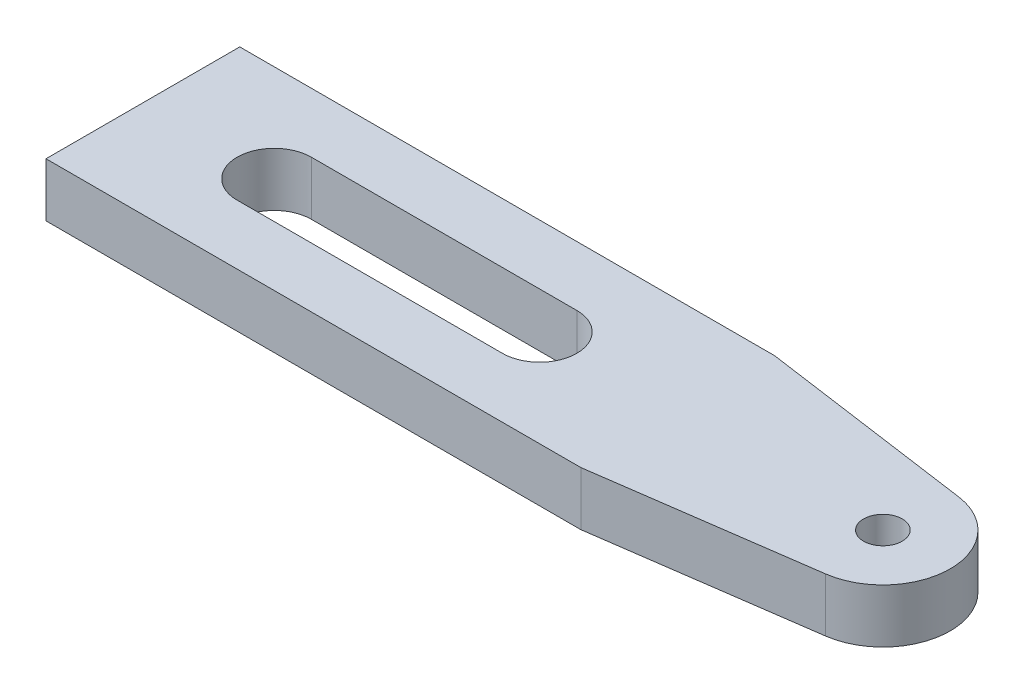
ISO-10303-21;
HEADER;
FILE_DESCRIPTION(('STEP AP214'),'2;1');
FILE_NAME('part.step','',(''),(''),'','','');
FILE_SCHEMA(('AUTOMOTIVE_DESIGN { 1 0 10303 214 1 1 1 1 }'));
ENDSEC;
DATA;
#1=APPLICATION_CONTEXT('core data for automotive mechanical design processes');
#2=APPLICATION_PROTOCOL_DEFINITION('international standard','automotive_design',2000,#1);
#3=PRODUCT_CONTEXT('',#1,'mechanical');
#4=PRODUCT('Part','Part','',(#3));
#5=PRODUCT_RELATED_PRODUCT_CATEGORY('part','',(#4));
#6=PRODUCT_DEFINITION_FORMATION('','',#4);
#7=PRODUCT_DEFINITION_CONTEXT('part definition',#1,'design');
#8=PRODUCT_DEFINITION('design','',#6,#7);
#9=PRODUCT_DEFINITION_SHAPE('','',#8);
#10=(LENGTH_UNIT() NAMED_UNIT(*) SI_UNIT(.MILLI.,.METRE.));
#11=(NAMED_UNIT(*) PLANE_ANGLE_UNIT() SI_UNIT($,.RADIAN.));
#12=(NAMED_UNIT(*) SI_UNIT($,.STERADIAN.) SOLID_ANGLE_UNIT());
#13=UNCERTAINTY_MEASURE_WITH_UNIT(LENGTH_MEASURE(1.E-05),#10,'distance_accuracy_value','');
#14=(GEOMETRIC_REPRESENTATION_CONTEXT(3) GLOBAL_UNCERTAINTY_ASSIGNED_CONTEXT((#13)) GLOBAL_UNIT_ASSIGNED_CONTEXT((#10,
#11,#12)) REPRESENTATION_CONTEXT('',''));
#15=CARTESIAN_POINT('',(0.,0.,0.));
#16=DIRECTION('',(0.,0.,1.));
#17=DIRECTION('',(1.,0.,0.));
#18=AXIS2_PLACEMENT_3D('',#15,#16,#17);
#19=CARTESIAN_POINT('',(-15.24,2.032,3.6576));
#20=DIRECTION('',(0.,0.,-1.));
#21=DIRECTION('',(-1.,0.,0.));
#22=AXIS2_PLACEMENT_3D('',#19,#20,#21);
#23=PLANE('',#22);
#24=DIRECTION('',(1.,0.,0.));
#25=VECTOR('',#24,1.);
#26=CARTESIAN_POINT('',(-15.24,0.,3.6576));
#27=LINE('',#26,#25);
#28=CARTESIAN_POINT('',(-15.24,0.,3.6576));
#29=VERTEX_POINT('',#28);
#30=CARTESIAN_POINT('',(4.953,0.,3.6576));
#31=VERTEX_POINT('',#30);
#32=EDGE_CURVE('E123',#29,#31,#27,.T.);
#33=ORIENTED_EDGE('',*,*,#32,.T.);
#34=DIRECTION('',(0.,-1.,0.));
#35=VECTOR('',#34,1.);
#36=CARTESIAN_POINT('',(4.953,2.032,3.6576));
#37=LINE('',#36,#35);
#38=CARTESIAN_POINT('',(4.953,2.032,3.6576));
#39=VERTEX_POINT('',#38);
#40=EDGE_CURVE('E11',#39,#31,#37,.T.);
#41=ORIENTED_EDGE('',*,*,#40,.F.);
#42=DIRECTION('',(1.,0.,0.));
#43=VECTOR('',#42,1.);
#44=CARTESIAN_POINT('',(-15.24,2.032,3.6576));
#45=LINE('',#44,#43);
#46=CARTESIAN_POINT('',(-15.24,2.032,3.6576));
#47=VERTEX_POINT('',#46);
#48=EDGE_CURVE('E146',#47,#39,#45,.T.);
#49=ORIENTED_EDGE('',*,*,#48,.F.);
#50=DIRECTION('',(0.,-1.,0.));
#51=VECTOR('',#50,1.);
#52=CARTESIAN_POINT('',(-15.24,2.032,3.6576));
#53=LINE('',#52,#51);
#54=EDGE_CURVE('E160',#47,#29,#53,.T.);
#55=ORIENTED_EDGE('',*,*,#54,.T.);
#56=EDGE_LOOP('',(#33,#41,#49,#55));
#57=FACE_BOUND('',#56,.T.);
#58=ADVANCED_FACE('F33',(#57),#23,.F.);
#59=CARTESIAN_POINT('',(4.953,2.032,3.6576));
#60=DIRECTION('',(-0.139636731357013,0.,-0.990202799054784));
#61=DIRECTION('',(-0.990202799054784,0.,0.139636731357013));
#62=AXIS2_PLACEMENT_3D('',#59,#60,#61);
#63=PLANE('',#62);
#64=DIRECTION('',(0.990202799054784,0.,-0.139636731357013));
#65=VECTOR('',#64,1.);
#66=CARTESIAN_POINT('',(4.953,0.,3.6576));
#67=LINE('',#66,#65);
#68=CARTESIAN_POINT('',(13.0546772976468,0.,2.51511510959915));
#69=VERTEX_POINT('',#68);
#70=EDGE_CURVE('E163',#31,#69,#67,.T.);
#71=ORIENTED_EDGE('',*,*,#70,.T.);
#72=DIRECTION('',(0.,-1.,0.));
#73=VECTOR('',#72,1.);
#74=CARTESIAN_POINT('',(13.0546772976468,2.032,2.51511510959915));
#75=LINE('',#74,#73);
#76=CARTESIAN_POINT('',(13.0546772976468,2.032,2.51511510959915));
#77=VERTEX_POINT('',#76);
#78=EDGE_CURVE('E40',#77,#69,#75,.T.);
#79=ORIENTED_EDGE('',*,*,#78,.F.);
#80=DIRECTION('',(0.990202799054784,0.,-0.139636731357013));
#81=VECTOR('',#80,1.);
#82=CARTESIAN_POINT('',(4.953,2.032,3.6576));
#83=LINE('',#82,#81);
#84=EDGE_CURVE('E149',#39,#77,#83,.T.);
#85=ORIENTED_EDGE('',*,*,#84,.F.);
#86=ORIENTED_EDGE('',*,*,#40,.T.);
#87=EDGE_LOOP('',(#71,#79,#85,#86));
#88=FACE_BOUND('',#87,.T.);
#89=ADVANCED_FACE('F208',(#88),#63,.F.);
#90=CARTESIAN_POINT('',(12.7,2.032,0.));
#91=DIRECTION('',(0.,-1.,0.));
#92=DIRECTION('',(0.,0.,-1.));
#93=AXIS2_PLACEMENT_3D('',#90,#91,#92);
#94=CYLINDRICAL_SURFACE('',#93,2.54);
#95=CARTESIAN_POINT('',(12.7,0.,0.));
#96=DIRECTION('',(0.,1.,0.));
#97=DIRECTION('',(0.,0.,1.));
#98=AXIS2_PLACEMENT_3D('',#95,#96,#97);
#99=CIRCLE('',#98,2.54);
#100=CARTESIAN_POINT('',(13.0546772976468,0.,-2.51511510959915));
#101=VERTEX_POINT('',#100);
#102=EDGE_CURVE('E165',#69,#101,#99,.T.);
#103=ORIENTED_EDGE('',*,*,#102,.T.);
#104=DIRECTION('',(0.,-1.,0.));
#105=VECTOR('',#104,1.);
#106=CARTESIAN_POINT('',(13.0546772976468,2.032,-2.51511510959915));
#107=LINE('',#106,#105);
#108=CARTESIAN_POINT('',(13.0546772976468,2.032,-2.51511510959915));
#109=VERTEX_POINT('',#108);
#110=EDGE_CURVE('E180',#109,#101,#107,.T.);
#111=ORIENTED_EDGE('',*,*,#110,.F.);
#112=CARTESIAN_POINT('',(12.7,2.032,0.));
#113=DIRECTION('',(0.,1.,0.));
#114=DIRECTION('',(0.,0.,1.));
#115=AXIS2_PLACEMENT_3D('',#112,#113,#114);
#116=CIRCLE('',#115,2.54);
#117=EDGE_CURVE('E152',#77,#109,#116,.T.);
#118=ORIENTED_EDGE('',*,*,#117,.F.);
#119=ORIENTED_EDGE('',*,*,#78,.T.);
#120=EDGE_LOOP('',(#103,#111,#118,#119));
#121=FACE_BOUND('',#120,.T.);
#122=ADVANCED_FACE('F187',(#121),#94,.T.);
#123=CARTESIAN_POINT('',(4.953,2.032,-3.6576));
#124=DIRECTION('',(-0.139636731357013,0.,0.990202799054784));
#125=DIRECTION('',(0.990202799054784,0.,0.139636731357013));
#126=AXIS2_PLACEMENT_3D('',#123,#124,#125);
#127=PLANE('',#126);
#128=DIRECTION('',(-0.990202799054784,0.,-0.139636731357013));
#129=VECTOR('',#128,1.);
#130=CARTESIAN_POINT('',(4.953,0.,-3.6576));
#131=LINE('',#130,#129);
#132=CARTESIAN_POINT('',(4.953,0.,-3.6576));
#133=VERTEX_POINT('',#132);
#134=EDGE_CURVE('E167',#101,#133,#131,.T.);
#135=ORIENTED_EDGE('',*,*,#134,.T.);
#136=DIRECTION('',(0.,-1.,0.));
#137=VECTOR('',#136,1.);
#138=CARTESIAN_POINT('',(4.953,2.032,-3.6576));
#139=LINE('',#138,#137);
#140=CARTESIAN_POINT('',(4.953,2.032,-3.6576));
#141=VERTEX_POINT('',#140);
#142=EDGE_CURVE('E177',#141,#133,#139,.T.);
#143=ORIENTED_EDGE('',*,*,#142,.F.);
#144=DIRECTION('',(-0.990202799054784,0.,-0.139636731357013));
#145=VECTOR('',#144,1.);
#146=CARTESIAN_POINT('',(4.953,2.032,-3.6576));
#147=LINE('',#146,#145);
#148=EDGE_CURVE('E154',#109,#141,#147,.T.);
#149=ORIENTED_EDGE('',*,*,#148,.F.);
#150=ORIENTED_EDGE('',*,*,#110,.T.);
#151=EDGE_LOOP('',(#135,#143,#149,#150));
#152=FACE_BOUND('',#151,.T.);
#153=ADVANCED_FACE('F196',(#152),#127,.F.);
#154=CARTESIAN_POINT('',(-15.24,2.032,-3.65760000000003));
#155=DIRECTION('',(0.,0.,1.));
#156=DIRECTION('',(1.,0.,0.));
#157=AXIS2_PLACEMENT_3D('',#154,#155,#156);
#158=PLANE('',#157);
#159=DIRECTION('',(-1.,0.,0.));
#160=VECTOR('',#159,1.);
#161=CARTESIAN_POINT('',(-15.24,0.,-3.65760000000003));
#162=LINE('',#161,#160);
#163=CARTESIAN_POINT('',(-15.24,0.,-3.65760000000003));
#164=VERTEX_POINT('',#163);
#165=EDGE_CURVE('E169',#133,#164,#162,.T.);
#166=ORIENTED_EDGE('',*,*,#165,.T.);
#167=DIRECTION('',(0.,-1.,0.));
#168=VECTOR('',#167,1.);
#169=CARTESIAN_POINT('',(-15.24,2.032,-3.65760000000003));
#170=LINE('',#169,#168);
#171=CARTESIAN_POINT('',(-15.24,2.032,-3.65760000000003));
#172=VERTEX_POINT('',#171);
#173=EDGE_CURVE('E174',#172,#164,#170,.T.);
#174=ORIENTED_EDGE('',*,*,#173,.F.);
#175=DIRECTION('',(-1.,0.,0.));
#176=VECTOR('',#175,1.);
#177=CARTESIAN_POINT('',(-15.24,2.032,-3.65760000000003));
#178=LINE('',#177,#176);
#179=EDGE_CURVE('E156',#141,#172,#178,.T.);
#180=ORIENTED_EDGE('',*,*,#179,.F.);
#181=ORIENTED_EDGE('',*,*,#142,.T.);
#182=EDGE_LOOP('',(#166,#174,#180,#181));
#183=FACE_BOUND('',#182,.T.);
#184=ADVANCED_FACE('F200',(#183),#158,.F.);
#185=CARTESIAN_POINT('',(-15.24,2.032,-3.65760000000003));
#186=DIRECTION('',(1.,0.,0.));
#187=DIRECTION('',(0.,0.,-1.));
#188=AXIS2_PLACEMENT_3D('',#185,#186,#187);
#189=PLANE('',#188);
#190=DIRECTION('',(0.,0.,1.));
#191=VECTOR('',#190,1.);
#192=CARTESIAN_POINT('',(-15.24,0.,-3.65760000000003));
#193=LINE('',#192,#191);
#194=EDGE_CURVE('E150',#164,#29,#193,.T.);
#195=ORIENTED_EDGE('',*,*,#194,.T.);
#196=ORIENTED_EDGE('',*,*,#54,.F.);
#197=DIRECTION('',(0.,0.,1.));
#198=VECTOR('',#197,1.);
#199=CARTESIAN_POINT('',(-15.24,2.032,-3.65760000000003));
#200=LINE('',#199,#198);
#201=EDGE_CURVE('E158',#172,#47,#200,.T.);
#202=ORIENTED_EDGE('',*,*,#201,.F.);
#203=ORIENTED_EDGE('',*,*,#173,.T.);
#204=EDGE_LOOP('',(#195,#196,#202,#203));
#205=FACE_BOUND('',#204,.T.);
#206=ADVANCED_FACE('F211',(#205),#189,.F.);
#207=CARTESIAN_POINT('',(12.7,2.032,0.));
#208=DIRECTION('',(0.,1.,0.));
#209=DIRECTION('',(0.,0.,1.));
#210=AXIS2_PLACEMENT_3D('',#207,#208,#209);
#211=PLANE('',#210);
#212=CARTESIAN_POINT('',(12.7,2.032,0.));
#213=DIRECTION('',(0.,1.,0.));
#214=DIRECTION('',(0.,0.,1.));
#215=AXIS2_PLACEMENT_3D('',#212,#213,#214);
#216=CIRCLE('',#215,0.730249999999999);
#217=CARTESIAN_POINT('',(12.7,2.032,0.730249999999999));
#218=VERTEX_POINT('',#217);
#219=EDGE_CURVE('E310',#218,#218,#216,.T.);
#220=ORIENTED_EDGE('',*,*,#219,.F.);
#221=EDGE_LOOP('',(#220));
#222=FACE_BOUND('',#221,.T.);
#223=CARTESIAN_POINT('',(-10.28065,2.032,0.));
#224=DIRECTION('',(0.,1.,0.));
#225=DIRECTION('',(0.,0.,1.));
#226=AXIS2_PLACEMENT_3D('',#223,#224,#225);
#227=CIRCLE('',#226,1.40335);
#228=CARTESIAN_POINT('',(-10.28065,2.032,-1.40335));
#229=VERTEX_POINT('',#228);
#230=CARTESIAN_POINT('',(-10.28065,2.032,1.40335));
#231=VERTEX_POINT('',#230);
#232=EDGE_CURVE('E47',#229,#231,#227,.T.);
#233=ORIENTED_EDGE('',*,*,#232,.F.);
#234=DIRECTION('',(-1.,0.,0.));
#235=VECTOR('',#234,1.);
#236=CARTESIAN_POINT('',(-10.28065,2.032,-1.40335));
#237=LINE('',#236,#235);
#238=CARTESIAN_POINT('',(-0.260349999999994,2.032,-1.40335));
#239=VERTEX_POINT('',#238);
#240=EDGE_CURVE('E117',#239,#229,#237,.T.);
#241=ORIENTED_EDGE('',*,*,#240,.F.);
#242=CARTESIAN_POINT('',(-0.260349999999994,2.032,0.));
#243=DIRECTION('',(0.,1.,0.));
#244=DIRECTION('',(0.,0.,1.));
#245=AXIS2_PLACEMENT_3D('',#242,#243,#244);
#246=CIRCLE('',#245,1.40335);
#247=CARTESIAN_POINT('',(-0.260349999999994,2.032,1.40335));
#248=VERTEX_POINT('',#247);
#249=EDGE_CURVE('E137',#248,#239,#246,.T.);
#250=ORIENTED_EDGE('',*,*,#249,.F.);
#251=DIRECTION('',(1.,0.,0.));
#252=VECTOR('',#251,1.);
#253=CARTESIAN_POINT('',(-10.28065,2.032,1.40335));
#254=LINE('',#253,#252);
#255=EDGE_CURVE('E131',#231,#248,#254,.T.);
#256=ORIENTED_EDGE('',*,*,#255,.F.);
#257=EDGE_LOOP('',(#233,#241,#250,#256));
#258=FACE_BOUND('',#257,.T.);
#259=ORIENTED_EDGE('',*,*,#48,.T.);
#260=ORIENTED_EDGE('',*,*,#84,.T.);
#261=ORIENTED_EDGE('',*,*,#117,.T.);
#262=ORIENTED_EDGE('',*,*,#148,.T.);
#263=ORIENTED_EDGE('',*,*,#179,.T.);
#264=ORIENTED_EDGE('',*,*,#201,.T.);
#265=EDGE_LOOP('',(#259,#260,#261,#262,#263,#264));
#266=FACE_BOUND('',#265,.T.);
#267=ADVANCED_FACE('F204',(#222,#258,#266),#211,.T.);
#268=CARTESIAN_POINT('',(12.7,0.,0.));
#269=DIRECTION('',(0.,1.,0.));
#270=DIRECTION('',(0.,0.,1.));
#271=AXIS2_PLACEMENT_3D('',#268,#269,#270);
#272=PLANE('',#271);
#273=CARTESIAN_POINT('',(12.7,0.,0.));
#274=DIRECTION('',(0.,1.,0.));
#275=DIRECTION('',(0.,0.,1.));
#276=AXIS2_PLACEMENT_3D('',#273,#274,#275);
#277=CIRCLE('',#276,0.730249999999999);
#278=CARTESIAN_POINT('',(12.7,0.,0.730249999999999));
#279=VERTEX_POINT('',#278);
#280=EDGE_CURVE('E313',#279,#279,#277,.F.);
#281=ORIENTED_EDGE('',*,*,#280,.F.);
#282=EDGE_LOOP('',(#281));
#283=FACE_BOUND('',#282,.T.);
#284=DIRECTION('',(1.,0.,0.));
#285=VECTOR('',#284,1.);
#286=CARTESIAN_POINT('',(-10.28065,0.,-1.40335));
#287=LINE('',#286,#285);
#288=CARTESIAN_POINT('',(-10.28065,0.,-1.40335));
#289=VERTEX_POINT('',#288);
#290=CARTESIAN_POINT('',(-0.260349999999994,0.,-1.40335));
#291=VERTEX_POINT('',#290);
#292=EDGE_CURVE('E129',#289,#291,#287,.T.);
#293=ORIENTED_EDGE('',*,*,#292,.F.);
#294=CARTESIAN_POINT('',(-10.28065,0.,0.));
#295=DIRECTION('',(0.,1.,0.));
#296=DIRECTION('',(0.,0.,1.));
#297=AXIS2_PLACEMENT_3D('',#294,#295,#296);
#298=CIRCLE('',#297,1.40335);
#299=CARTESIAN_POINT('',(-10.28065,0.,1.40335));
#300=VERTEX_POINT('',#299);
#301=EDGE_CURVE('E111',#300,#289,#298,.F.);
#302=ORIENTED_EDGE('',*,*,#301,.F.);
#303=DIRECTION('',(-1.,0.,0.));
#304=VECTOR('',#303,1.);
#305=CARTESIAN_POINT('',(-10.28065,0.,1.40335));
#306=LINE('',#305,#304);
#307=CARTESIAN_POINT('',(-0.260349999999994,0.,1.40335));
#308=VERTEX_POINT('',#307);
#309=EDGE_CURVE('E120',#308,#300,#306,.T.);
#310=ORIENTED_EDGE('',*,*,#309,.F.);
#311=CARTESIAN_POINT('',(-0.260349999999994,0.,0.));
#312=DIRECTION('',(0.,1.,0.));
#313=DIRECTION('',(0.,0.,1.));
#314=AXIS2_PLACEMENT_3D('',#311,#312,#313);
#315=CIRCLE('',#314,1.40335);
#316=EDGE_CURVE('E55',#291,#308,#315,.F.);
#317=ORIENTED_EDGE('',*,*,#316,.F.);
#318=EDGE_LOOP('',(#293,#302,#310,#317));
#319=FACE_BOUND('',#318,.T.);
#320=ORIENTED_EDGE('',*,*,#32,.F.);
#321=ORIENTED_EDGE('',*,*,#194,.F.);
#322=ORIENTED_EDGE('',*,*,#165,.F.);
#323=ORIENTED_EDGE('',*,*,#134,.F.);
#324=ORIENTED_EDGE('',*,*,#102,.F.);
#325=ORIENTED_EDGE('',*,*,#70,.F.);
#326=EDGE_LOOP('',(#320,#321,#322,#323,#324,#325));
#327=FACE_BOUND('',#326,.T.);
#328=ADVANCED_FACE('F126',(#283,#319,#327),#272,.F.);
#329=CARTESIAN_POINT('',(-10.28065,-0.00100000000000013,0.));
#330=DIRECTION('',(0.,1.,0.));
#331=DIRECTION('',(0.,0.,1.));
#332=AXIS2_PLACEMENT_3D('',#329,#330,#331);
#333=CYLINDRICAL_SURFACE('',#332,1.40335);
#334=ORIENTED_EDGE('',*,*,#301,.T.);
#335=DIRECTION('',(0.,1.,0.));
#336=VECTOR('',#335,1.);
#337=CARTESIAN_POINT('',(-10.28065,-0.00100000000000013,-1.40335));
#338=LINE('',#337,#336);
#339=EDGE_CURVE('E124',#289,#229,#338,.T.);
#340=ORIENTED_EDGE('',*,*,#339,.T.);
#341=ORIENTED_EDGE('',*,*,#232,.T.);
#342=DIRECTION('',(0.,1.,0.));
#343=VECTOR('',#342,1.);
#344=CARTESIAN_POINT('',(-10.28065,-0.00100000000000013,1.40335));
#345=LINE('',#344,#343);
#346=EDGE_CURVE('E107',#300,#231,#345,.T.);
#347=ORIENTED_EDGE('',*,*,#346,.F.);
#348=EDGE_LOOP('',(#334,#340,#341,#347));
#349=FACE_BOUND('',#348,.T.);
#350=ADVANCED_FACE('F109',(#349),#333,.F.);
#351=CARTESIAN_POINT('',(-10.28065,-0.00100000000000013,-1.40335));
#352=DIRECTION('',(0.,0.,-1.));
#353=DIRECTION('',(-1.,0.,0.));
#354=AXIS2_PLACEMENT_3D('',#351,#352,#353);
#355=PLANE('',#354);
#356=ORIENTED_EDGE('',*,*,#292,.T.);
#357=DIRECTION('',(0.,1.,0.));
#358=VECTOR('',#357,1.);
#359=CARTESIAN_POINT('',(-0.260349999999994,-0.00100000000000013,-1.40335));
#360=LINE('',#359,#358);
#361=EDGE_CURVE('E143',#291,#239,#360,.T.);
#362=ORIENTED_EDGE('',*,*,#361,.T.);
#363=ORIENTED_EDGE('',*,*,#240,.T.);
#364=ORIENTED_EDGE('',*,*,#339,.F.);
#365=EDGE_LOOP('',(#356,#362,#363,#364));
#366=FACE_BOUND('',#365,.T.);
#367=ADVANCED_FACE('F254',(#366),#355,.F.);
#368=CARTESIAN_POINT('',(-0.260349999999994,-0.00100000000000013,0.));
#369=DIRECTION('',(0.,1.,0.));
#370=DIRECTION('',(0.,0.,1.));
#371=AXIS2_PLACEMENT_3D('',#368,#369,#370);
#372=CYLINDRICAL_SURFACE('',#371,1.40335);
#373=ORIENTED_EDGE('',*,*,#316,.T.);
#374=DIRECTION('',(0.,1.,0.));
#375=VECTOR('',#374,1.);
#376=CARTESIAN_POINT('',(-0.260349999999994,-0.00100000000000013,1.40335));
#377=LINE('',#376,#375);
#378=EDGE_CURVE('E116',#308,#248,#377,.T.);
#379=ORIENTED_EDGE('',*,*,#378,.T.);
#380=ORIENTED_EDGE('',*,*,#249,.T.);
#381=ORIENTED_EDGE('',*,*,#361,.F.);
#382=EDGE_LOOP('',(#373,#379,#380,#381));
#383=FACE_BOUND('',#382,.T.);
#384=ADVANCED_FACE('F265',(#383),#372,.F.);
#385=CARTESIAN_POINT('',(-10.28065,-0.00100000000000013,1.40335));
#386=DIRECTION('',(0.,0.,1.));
#387=DIRECTION('',(1.,0.,0.));
#388=AXIS2_PLACEMENT_3D('',#385,#386,#387);
#389=PLANE('',#388);
#390=ORIENTED_EDGE('',*,*,#309,.T.);
#391=ORIENTED_EDGE('',*,*,#346,.T.);
#392=ORIENTED_EDGE('',*,*,#255,.T.);
#393=ORIENTED_EDGE('',*,*,#378,.F.);
#394=EDGE_LOOP('',(#390,#391,#392,#393));
#395=FACE_BOUND('',#394,.T.);
#396=ADVANCED_FACE('F121',(#395),#389,.F.);
#397=CARTESIAN_POINT('',(12.7,-0.00100000000000013,0.));
#398=DIRECTION('',(0.,1.,0.));
#399=DIRECTION('',(0.,0.,1.));
#400=AXIS2_PLACEMENT_3D('',#397,#398,#399);
#401=CYLINDRICAL_SURFACE('',#400,0.730249999999999);
#402=ORIENTED_EDGE('',*,*,#219,.T.);
#403=EDGE_LOOP('',(#402));
#404=FACE_BOUND('',#403,.T.);
#405=ORIENTED_EDGE('',*,*,#280,.T.);
#406=EDGE_LOOP('',(#405));
#407=FACE_BOUND('',#406,.T.);
#408=ADVANCED_FACE('F283',(#404,#407),#401,.F.);
#409=CLOSED_SHELL('',(#58,#89,#122,#153,#184,#206,#267,#328,#350,#367,#384,#396,#408));
#410=MANIFOLD_SOLID_BREP('B2',#409);
#411=ADVANCED_BREP_SHAPE_REPRESENTATION('',(#18,#410),#14);
#412=SHAPE_DEFINITION_REPRESENTATION(#9,#411);
ENDSEC;
END-ISO-10303-21;
